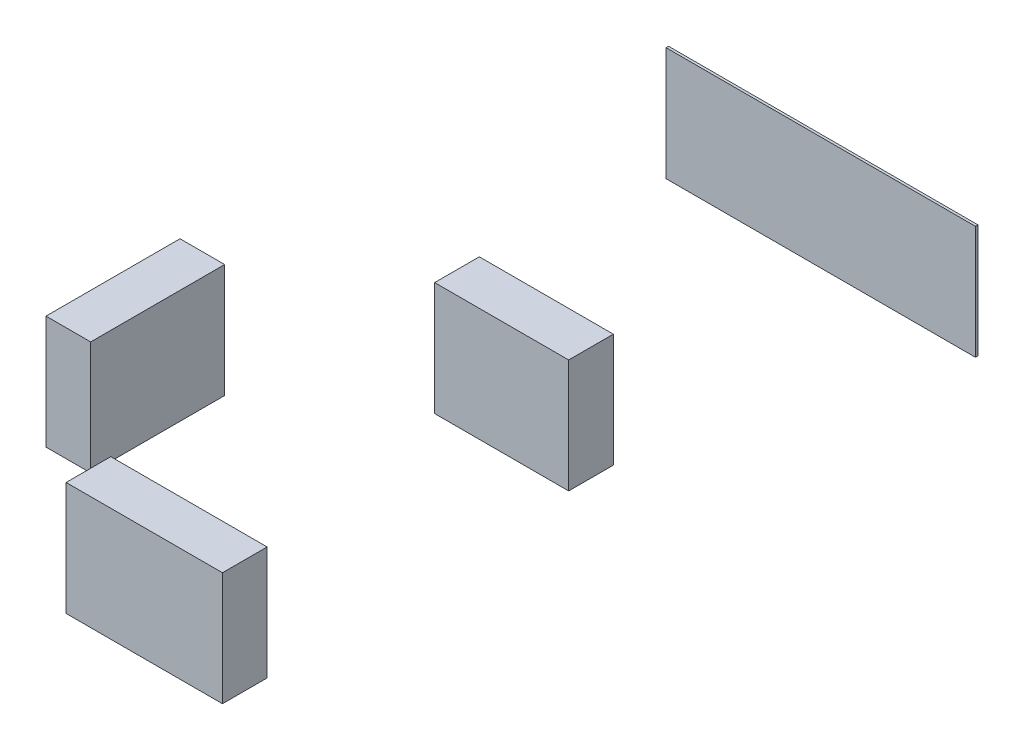
ISO-10303-21;
HEADER;
FILE_DESCRIPTION(('STEP AP214'),'2;1');
FILE_NAME('part.step','',(''),(''),'','','');
FILE_SCHEMA(('AUTOMOTIVE_DESIGN { 1 0 10303 214 1 1 1 1 }'));
ENDSEC;
DATA;
#1=APPLICATION_CONTEXT('core data for automotive mechanical design processes');
#2=APPLICATION_PROTOCOL_DEFINITION('international standard','automotive_design',2000,#1);
#3=PRODUCT_CONTEXT('',#1,'mechanical');
#4=PRODUCT('Part','Part','',(#3));
#5=PRODUCT_RELATED_PRODUCT_CATEGORY('part','',(#4));
#6=PRODUCT_DEFINITION_FORMATION('','',#4);
#7=PRODUCT_DEFINITION_CONTEXT('part definition',#1,'design');
#8=PRODUCT_DEFINITION('design','',#6,#7);
#9=PRODUCT_DEFINITION_SHAPE('','',#8);
#10=(LENGTH_UNIT() NAMED_UNIT(*) SI_UNIT(.MILLI.,.METRE.));
#11=(NAMED_UNIT(*) PLANE_ANGLE_UNIT() SI_UNIT($,.RADIAN.));
#12=(NAMED_UNIT(*) SI_UNIT($,.STERADIAN.) SOLID_ANGLE_UNIT());
#13=UNCERTAINTY_MEASURE_WITH_UNIT(LENGTH_MEASURE(1.E-05),#10,'distance_accuracy_value','');
#14=(GEOMETRIC_REPRESENTATION_CONTEXT(3) GLOBAL_UNCERTAINTY_ASSIGNED_CONTEXT((#13)) GLOBAL_UNIT_ASSIGNED_CONTEXT((#10,
#11,#12)) REPRESENTATION_CONTEXT('',''));
#15=CARTESIAN_POINT('',(0.,0.,0.));
#16=DIRECTION('',(0.,0.,1.));
#17=DIRECTION('',(1.,0.,0.));
#18=AXIS2_PLACEMENT_3D('',#15,#16,#17);
#19=CARTESIAN_POINT('',(3.2,2.54,-9.00000000000001));
#20=DIRECTION('',(1.,0.,0.));
#21=DIRECTION('',(0.,0.,-1.));
#22=AXIS2_PLACEMENT_3D('',#19,#20,#21);
#23=PLANE('',#22);
#24=DIRECTION('',(0.,0.,1.));
#25=VECTOR('',#24,1.);
#26=CARTESIAN_POINT('',(3.2,0.,-9.00000000000001));
#27=LINE('',#26,#25);
#28=CARTESIAN_POINT('',(3.2,0.,-9.00000000000001));
#29=VERTEX_POINT('',#28);
#30=CARTESIAN_POINT('',(3.2,0.,-8.00000000000001));
#31=VERTEX_POINT('',#30);
#32=EDGE_CURVE('E107',#29,#31,#27,.T.);
#33=ORIENTED_EDGE('',*,*,#32,.T.);
#34=DIRECTION('',(0.,-1.,0.));
#35=VECTOR('',#34,1.);
#36=CARTESIAN_POINT('',(3.2,2.54,-8.00000000000001));
#37=LINE('',#36,#35);
#38=CARTESIAN_POINT('',(3.2,2.54,-8.00000000000001));
#39=VERTEX_POINT('',#38);
#40=EDGE_CURVE('E12',#39,#31,#37,.T.);
#41=ORIENTED_EDGE('',*,*,#40,.F.);
#42=DIRECTION('',(0.,0.,1.));
#43=VECTOR('',#42,1.);
#44=CARTESIAN_POINT('',(3.2,2.54,-9.00000000000001));
#45=LINE('',#44,#43);
#46=CARTESIAN_POINT('',(3.2,2.54,-9.00000000000001));
#47=VERTEX_POINT('',#46);
#48=EDGE_CURVE('E95',#47,#39,#45,.T.);
#49=ORIENTED_EDGE('',*,*,#48,.F.);
#50=DIRECTION('',(0.,-1.,0.));
#51=VECTOR('',#50,1.);
#52=CARTESIAN_POINT('',(3.2,2.54,-9.00000000000001));
#53=LINE('',#52,#51);
#54=EDGE_CURVE('E103',#47,#29,#53,.T.);
#55=ORIENTED_EDGE('',*,*,#54,.T.);
#56=EDGE_LOOP('',(#33,#41,#49,#55));
#57=FACE_BOUND('',#56,.T.);
#58=ADVANCED_FACE('F44',(#57),#23,.F.);
#59=CARTESIAN_POINT('',(3.2,2.54,-8.00000000000001));
#60=DIRECTION('',(0.,0.,-1.));
#61=DIRECTION('',(-1.,0.,0.));
#62=AXIS2_PLACEMENT_3D('',#59,#60,#61);
#63=PLANE('',#62);
#64=DIRECTION('',(1.,0.,0.));
#65=VECTOR('',#64,1.);
#66=CARTESIAN_POINT('',(3.2,0.,-8.00000000000001));
#67=LINE('',#66,#65);
#68=CARTESIAN_POINT('',(6.2,0.,-8.00000000000001));
#69=VERTEX_POINT('',#68);
#70=EDGE_CURVE('E99',#31,#69,#67,.T.);
#71=ORIENTED_EDGE('',*,*,#70,.T.);
#72=DIRECTION('',(0.,-1.,0.));
#73=VECTOR('',#72,1.);
#74=CARTESIAN_POINT('',(6.2,2.54,-8.00000000000001));
#75=LINE('',#74,#73);
#76=CARTESIAN_POINT('',(6.2,2.54,-8.00000000000001));
#77=VERTEX_POINT('',#76);
#78=EDGE_CURVE('E52',#77,#69,#75,.T.);
#79=ORIENTED_EDGE('',*,*,#78,.F.);
#80=DIRECTION('',(1.,0.,0.));
#81=VECTOR('',#80,1.);
#82=CARTESIAN_POINT('',(3.2,2.54,-8.00000000000001));
#83=LINE('',#82,#81);
#84=EDGE_CURVE('E90',#39,#77,#83,.T.);
#85=ORIENTED_EDGE('',*,*,#84,.F.);
#86=ORIENTED_EDGE('',*,*,#40,.T.);
#87=EDGE_LOOP('',(#71,#79,#85,#86));
#88=FACE_BOUND('',#87,.T.);
#89=ADVANCED_FACE('F98',(#88),#63,.F.);
#90=CARTESIAN_POINT('',(6.2,2.54,-9.00000000000001));
#91=DIRECTION('',(-1.,0.,0.));
#92=DIRECTION('',(0.,0.,1.));
#93=AXIS2_PLACEMENT_3D('',#90,#91,#92);
#94=PLANE('',#93);
#95=DIRECTION('',(0.,0.,-1.));
#96=VECTOR('',#95,1.);
#97=CARTESIAN_POINT('',(6.2,0.,-9.00000000000001));
#98=LINE('',#97,#96);
#99=CARTESIAN_POINT('',(6.2,0.,-9.00000000000001));
#100=VERTEX_POINT('',#99);
#101=EDGE_CURVE('E77',#69,#100,#98,.T.);
#102=ORIENTED_EDGE('',*,*,#101,.T.);
#103=DIRECTION('',(0.,-1.,0.));
#104=VECTOR('',#103,1.);
#105=CARTESIAN_POINT('',(6.2,2.54,-9.00000000000001));
#106=LINE('',#105,#104);
#107=CARTESIAN_POINT('',(6.2,2.54,-9.00000000000001));
#108=VERTEX_POINT('',#107);
#109=EDGE_CURVE('E100',#108,#100,#106,.T.);
#110=ORIENTED_EDGE('',*,*,#109,.F.);
#111=DIRECTION('',(0.,0.,-1.));
#112=VECTOR('',#111,1.);
#113=CARTESIAN_POINT('',(6.2,2.54,-9.00000000000001));
#114=LINE('',#113,#112);
#115=EDGE_CURVE('E93',#77,#108,#114,.T.);
#116=ORIENTED_EDGE('',*,*,#115,.F.);
#117=ORIENTED_EDGE('',*,*,#78,.T.);
#118=EDGE_LOOP('',(#102,#110,#116,#117));
#119=FACE_BOUND('',#118,.T.);
#120=ADVANCED_FACE('F101',(#119),#94,.F.);
#121=CARTESIAN_POINT('',(3.2,2.54,-9.00000000000001));
#122=DIRECTION('',(0.,0.,1.));
#123=DIRECTION('',(1.,0.,0.));
#124=AXIS2_PLACEMENT_3D('',#121,#122,#123);
#125=PLANE('',#124);
#126=DIRECTION('',(-1.,0.,0.));
#127=VECTOR('',#126,1.);
#128=CARTESIAN_POINT('',(3.2,0.,-9.00000000000001));
#129=LINE('',#128,#127);
#130=EDGE_CURVE('E83',#100,#29,#129,.T.);
#131=ORIENTED_EDGE('',*,*,#130,.T.);
#132=ORIENTED_EDGE('',*,*,#54,.F.);
#133=DIRECTION('',(-1.,0.,0.));
#134=VECTOR('',#133,1.);
#135=CARTESIAN_POINT('',(3.2,2.54,-9.00000000000001));
#136=LINE('',#135,#134);
#137=EDGE_CURVE('E60',#108,#47,#136,.T.);
#138=ORIENTED_EDGE('',*,*,#137,.F.);
#139=ORIENTED_EDGE('',*,*,#109,.T.);
#140=EDGE_LOOP('',(#131,#132,#138,#139));
#141=FACE_BOUND('',#140,.T.);
#142=ADVANCED_FACE('F114',(#141),#125,.F.);
#143=CARTESIAN_POINT('',(3.2,2.54,-8.00000000000001));
#144=DIRECTION('',(0.,1.,0.));
#145=DIRECTION('',(0.,0.,1.));
#146=AXIS2_PLACEMENT_3D('',#143,#144,#145);
#147=PLANE('',#146);
#148=ORIENTED_EDGE('',*,*,#48,.T.);
#149=ORIENTED_EDGE('',*,*,#84,.T.);
#150=ORIENTED_EDGE('',*,*,#115,.T.);
#151=ORIENTED_EDGE('',*,*,#137,.T.);
#152=EDGE_LOOP('',(#148,#149,#150,#151));
#153=FACE_BOUND('',#152,.T.);
#154=ADVANCED_FACE('F91',(#153),#147,.T.);
#155=CARTESIAN_POINT('',(3.2,0.,-8.00000000000001));
#156=DIRECTION('',(0.,1.,0.));
#157=DIRECTION('',(0.,0.,1.));
#158=AXIS2_PLACEMENT_3D('',#155,#156,#157);
#159=PLANE('',#158);
#160=ORIENTED_EDGE('',*,*,#32,.F.);
#161=ORIENTED_EDGE('',*,*,#130,.F.);
#162=ORIENTED_EDGE('',*,*,#101,.F.);
#163=ORIENTED_EDGE('',*,*,#70,.F.);
#164=EDGE_LOOP('',(#160,#161,#162,#163));
#165=FACE_BOUND('',#164,.T.);
#166=ADVANCED_FACE('F117',(#165),#159,.F.);
#167=CLOSED_SHELL('',(#58,#89,#120,#142,#154,#166));
#168=MANIFOLD_SOLID_BREP('B2',#167);
#169=CARTESIAN_POINT('',(1.23679045429839,2.54,-15.1440851220631));
#170=DIRECTION('',(1.,0.,0.));
#171=DIRECTION('',(0.,0.,-1.));
#172=AXIS2_PLACEMENT_3D('',#169,#170,#171);
#173=PLANE('',#172);
#174=DIRECTION('',(0.,0.,1.));
#175=VECTOR('',#174,1.);
#176=CARTESIAN_POINT('',(1.23679045429839,0.,-15.1440851220631));
#177=LINE('',#176,#175);
#178=CARTESIAN_POINT('',(1.23679045429839,0.,-15.2));
#179=VERTEX_POINT('',#178);
#180=CARTESIAN_POINT('',(1.23679045429839,0.,-15.1440851220631));
#181=VERTEX_POINT('',#180);
#182=EDGE_CURVE('E241',#179,#181,#177,.T.);
#183=ORIENTED_EDGE('',*,*,#182,.T.);
#184=DIRECTION('',(0.,-1.,0.));
#185=VECTOR('',#184,1.);
#186=CARTESIAN_POINT('',(1.23679045429839,2.54,-15.1440851220631));
#187=LINE('',#186,#185);
#188=CARTESIAN_POINT('',(1.23679045429839,2.54,-15.1440851220631));
#189=VERTEX_POINT('',#188);
#190=EDGE_CURVE('E42',#189,#181,#187,.T.);
#191=ORIENTED_EDGE('',*,*,#190,.F.);
#192=DIRECTION('',(0.,0.,1.));
#193=VECTOR('',#192,1.);
#194=CARTESIAN_POINT('',(1.23679045429839,2.54,-15.1440851220631));
#195=LINE('',#194,#193);
#196=CARTESIAN_POINT('',(1.23679045429839,2.54,-15.2));
#197=VERTEX_POINT('',#196);
#198=EDGE_CURVE('E229',#197,#189,#195,.T.);
#199=ORIENTED_EDGE('',*,*,#198,.F.);
#200=DIRECTION('',(0.,-1.,0.));
#201=VECTOR('',#200,1.);
#202=CARTESIAN_POINT('',(1.23679045429839,2.54,-15.2));
#203=LINE('',#202,#201);
#204=EDGE_CURVE('E237',#197,#179,#203,.T.);
#205=ORIENTED_EDGE('',*,*,#204,.T.);
#206=EDGE_LOOP('',(#183,#191,#199,#205));
#207=FACE_BOUND('',#206,.T.);
#208=ADVANCED_FACE('F178',(#207),#173,.F.);
#209=CARTESIAN_POINT('',(8.16320954570161,2.54,-15.1440851220631));
#210=DIRECTION('',(0.,0.,-1.));
#211=DIRECTION('',(-1.,0.,0.));
#212=AXIS2_PLACEMENT_3D('',#209,#210,#211);
#213=PLANE('',#212);
#214=DIRECTION('',(1.,0.,0.));
#215=VECTOR('',#214,1.);
#216=CARTESIAN_POINT('',(8.16320954570161,0.,-15.1440851220631));
#217=LINE('',#216,#215);
#218=CARTESIAN_POINT('',(8.16320954570161,0.,-15.1440851220631));
#219=VERTEX_POINT('',#218);
#220=EDGE_CURVE('E233',#181,#219,#217,.T.);
#221=ORIENTED_EDGE('',*,*,#220,.T.);
#222=DIRECTION('',(0.,-1.,0.));
#223=VECTOR('',#222,1.);
#224=CARTESIAN_POINT('',(8.16320954570161,2.54,-15.1440851220631));
#225=LINE('',#224,#223);
#226=CARTESIAN_POINT('',(8.16320954570161,2.54,-15.1440851220631));
#227=VERTEX_POINT('',#226);
#228=EDGE_CURVE('E186',#227,#219,#225,.T.);
#229=ORIENTED_EDGE('',*,*,#228,.F.);
#230=DIRECTION('',(1.,0.,0.));
#231=VECTOR('',#230,1.);
#232=CARTESIAN_POINT('',(8.16320954570161,2.54,-15.1440851220631));
#233=LINE('',#232,#231);
#234=EDGE_CURVE('E224',#189,#227,#233,.T.);
#235=ORIENTED_EDGE('',*,*,#234,.F.);
#236=ORIENTED_EDGE('',*,*,#190,.T.);
#237=EDGE_LOOP('',(#221,#229,#235,#236));
#238=FACE_BOUND('',#237,.T.);
#239=ADVANCED_FACE('F232',(#238),#213,.F.);
#240=CARTESIAN_POINT('',(8.16320954570161,2.54,-15.2));
#241=DIRECTION('',(-1.,0.,0.));
#242=DIRECTION('',(0.,0.,1.));
#243=AXIS2_PLACEMENT_3D('',#240,#241,#242);
#244=PLANE('',#243);
#245=DIRECTION('',(0.,0.,-1.));
#246=VECTOR('',#245,1.);
#247=CARTESIAN_POINT('',(8.16320954570161,0.,-15.2));
#248=LINE('',#247,#246);
#249=CARTESIAN_POINT('',(8.16320954570161,0.,-15.2));
#250=VERTEX_POINT('',#249);
#251=EDGE_CURVE('E211',#219,#250,#248,.T.);
#252=ORIENTED_EDGE('',*,*,#251,.T.);
#253=DIRECTION('',(0.,-1.,0.));
#254=VECTOR('',#253,1.);
#255=CARTESIAN_POINT('',(8.16320954570161,2.54,-15.2));
#256=LINE('',#255,#254);
#257=CARTESIAN_POINT('',(8.16320954570161,2.54,-15.2));
#258=VERTEX_POINT('',#257);
#259=EDGE_CURVE('E234',#258,#250,#256,.T.);
#260=ORIENTED_EDGE('',*,*,#259,.F.);
#261=DIRECTION('',(0.,0.,-1.));
#262=VECTOR('',#261,1.);
#263=CARTESIAN_POINT('',(8.16320954570161,2.54,-15.2));
#264=LINE('',#263,#262);
#265=EDGE_CURVE('E227',#227,#258,#264,.T.);
#266=ORIENTED_EDGE('',*,*,#265,.F.);
#267=ORIENTED_EDGE('',*,*,#228,.T.);
#268=EDGE_LOOP('',(#252,#260,#266,#267));
#269=FACE_BOUND('',#268,.T.);
#270=ADVANCED_FACE('F235',(#269),#244,.F.);
#271=CARTESIAN_POINT('',(1.23679045429839,2.54,-15.2));
#272=DIRECTION('',(0.,0.,1.));
#273=DIRECTION('',(1.,0.,0.));
#274=AXIS2_PLACEMENT_3D('',#271,#272,#273);
#275=PLANE('',#274);
#276=DIRECTION('',(-1.,0.,0.));
#277=VECTOR('',#276,1.);
#278=CARTESIAN_POINT('',(1.23679045429839,0.,-15.2));
#279=LINE('',#278,#277);
#280=EDGE_CURVE('E217',#250,#179,#279,.T.);
#281=ORIENTED_EDGE('',*,*,#280,.T.);
#282=ORIENTED_EDGE('',*,*,#204,.F.);
#283=DIRECTION('',(-1.,0.,0.));
#284=VECTOR('',#283,1.);
#285=CARTESIAN_POINT('',(1.23679045429839,2.54,-15.2));
#286=LINE('',#285,#284);
#287=EDGE_CURVE('E194',#258,#197,#286,.T.);
#288=ORIENTED_EDGE('',*,*,#287,.F.);
#289=ORIENTED_EDGE('',*,*,#259,.T.);
#290=EDGE_LOOP('',(#281,#282,#288,#289));
#291=FACE_BOUND('',#290,.T.);
#292=ADVANCED_FACE('F248',(#291),#275,.F.);
#293=CARTESIAN_POINT('',(1.23679045429839,2.54,-15.2));
#294=DIRECTION('',(0.,-1.,0.));
#295=DIRECTION('',(0.,0.,-1.));
#296=AXIS2_PLACEMENT_3D('',#293,#294,#295);
#297=PLANE('',#296);
#298=ORIENTED_EDGE('',*,*,#198,.T.);
#299=ORIENTED_EDGE('',*,*,#234,.T.);
#300=ORIENTED_EDGE('',*,*,#265,.T.);
#301=ORIENTED_EDGE('',*,*,#287,.T.);
#302=EDGE_LOOP('',(#298,#299,#300,#301));
#303=FACE_BOUND('',#302,.T.);
#304=ADVANCED_FACE('F225',(#303),#297,.F.);
#305=CARTESIAN_POINT('',(1.23679045429839,0.,-15.2));
#306=DIRECTION('',(0.,-1.,0.));
#307=DIRECTION('',(0.,0.,-1.));
#308=AXIS2_PLACEMENT_3D('',#305,#306,#307);
#309=PLANE('',#308);
#310=ORIENTED_EDGE('',*,*,#182,.F.);
#311=ORIENTED_EDGE('',*,*,#280,.F.);
#312=ORIENTED_EDGE('',*,*,#251,.F.);
#313=ORIENTED_EDGE('',*,*,#220,.F.);
#314=EDGE_LOOP('',(#310,#311,#312,#313));
#315=FACE_BOUND('',#314,.T.);
#316=ADVANCED_FACE('F251',(#315),#309,.T.);
#317=CLOSED_SHELL('',(#208,#239,#270,#292,#304,#316));
#318=MANIFOLD_SOLID_BREP('B6',#317);
#319=CARTESIAN_POINT('',(-0.500000000000004,2.54,-6.00000000000001));
#320=DIRECTION('',(1.,0.,0.));
#321=DIRECTION('',(0.,0.,-1.));
#322=AXIS2_PLACEMENT_3D('',#319,#320,#321);
#323=PLANE('',#322);
#324=DIRECTION('',(0.,0.,1.));
#325=VECTOR('',#324,1.);
#326=CARTESIAN_POINT('',(-0.500000000000004,0.,-6.00000000000001));
#327=LINE('',#326,#325);
#328=CARTESIAN_POINT('',(-0.500000000000004,0.,-6.00000000000001));
#329=VERTEX_POINT('',#328);
#330=CARTESIAN_POINT('',(-0.5,0.,-3.));
#331=VERTEX_POINT('',#330);
#332=EDGE_CURVE('E374',#329,#331,#327,.T.);
#333=ORIENTED_EDGE('',*,*,#332,.T.);
#334=DIRECTION('',(0.,-1.,0.));
#335=VECTOR('',#334,1.);
#336=CARTESIAN_POINT('',(-0.5,2.54,-3.));
#337=LINE('',#336,#335);
#338=CARTESIAN_POINT('',(-0.5,2.54,-3.));
#339=VERTEX_POINT('',#338);
#340=EDGE_CURVE('E176',#339,#331,#337,.T.);
#341=ORIENTED_EDGE('',*,*,#340,.F.);
#342=DIRECTION('',(0.,0.,1.));
#343=VECTOR('',#342,1.);
#344=CARTESIAN_POINT('',(-0.500000000000004,2.54,-6.00000000000001));
#345=LINE('',#344,#343);
#346=CARTESIAN_POINT('',(-0.500000000000004,2.54,-6.00000000000001));
#347=VERTEX_POINT('',#346);
#348=EDGE_CURVE('E362',#347,#339,#345,.T.);
#349=ORIENTED_EDGE('',*,*,#348,.F.);
#350=DIRECTION('',(0.,-1.,0.));
#351=VECTOR('',#350,1.);
#352=CARTESIAN_POINT('',(-0.500000000000004,2.54,-6.00000000000001));
#353=LINE('',#352,#351);
#354=EDGE_CURVE('E370',#347,#329,#353,.T.);
#355=ORIENTED_EDGE('',*,*,#354,.T.);
#356=EDGE_LOOP('',(#333,#341,#349,#355));
#357=FACE_BOUND('',#356,.T.);
#358=ADVANCED_FACE('F311',(#357),#323,.F.);
#359=CARTESIAN_POINT('',(-0.5,2.54,-3.));
#360=DIRECTION('',(0.,0.,-1.));
#361=DIRECTION('',(-1.,0.,0.));
#362=AXIS2_PLACEMENT_3D('',#359,#360,#361);
#363=PLANE('',#362);
#364=DIRECTION('',(1.,0.,0.));
#365=VECTOR('',#364,1.);
#366=CARTESIAN_POINT('',(-0.5,0.,-3.));
#367=LINE('',#366,#365);
#368=CARTESIAN_POINT('',(0.5,0.,-3.));
#369=VERTEX_POINT('',#368);
#370=EDGE_CURVE('E366',#331,#369,#367,.T.);
#371=ORIENTED_EDGE('',*,*,#370,.T.);
#372=DIRECTION('',(0.,-1.,0.));
#373=VECTOR('',#372,1.);
#374=CARTESIAN_POINT('',(0.5,2.54,-3.));
#375=LINE('',#374,#373);
#376=CARTESIAN_POINT('',(0.5,2.54,-3.));
#377=VERTEX_POINT('',#376);
#378=EDGE_CURVE('E319',#377,#369,#375,.T.);
#379=ORIENTED_EDGE('',*,*,#378,.F.);
#380=DIRECTION('',(1.,0.,0.));
#381=VECTOR('',#380,1.);
#382=CARTESIAN_POINT('',(-0.5,2.54,-3.));
#383=LINE('',#382,#381);
#384=EDGE_CURVE('E357',#339,#377,#383,.T.);
#385=ORIENTED_EDGE('',*,*,#384,.F.);
#386=ORIENTED_EDGE('',*,*,#340,.T.);
#387=EDGE_LOOP('',(#371,#379,#385,#386));
#388=FACE_BOUND('',#387,.T.);
#389=ADVANCED_FACE('F365',(#388),#363,.F.);
#390=CARTESIAN_POINT('',(0.500000000000004,2.54,-6.00000000000001));
#391=DIRECTION('',(-1.,0.,0.));
#392=DIRECTION('',(0.,0.,1.));
#393=AXIS2_PLACEMENT_3D('',#390,#391,#392);
#394=PLANE('',#393);
#395=DIRECTION('',(0.,0.,-1.));
#396=VECTOR('',#395,1.);
#397=CARTESIAN_POINT('',(0.500000000000004,0.,-6.00000000000001));
#398=LINE('',#397,#396);
#399=CARTESIAN_POINT('',(0.500000000000004,0.,-6.00000000000001));
#400=VERTEX_POINT('',#399);
#401=EDGE_CURVE('E344',#369,#400,#398,.T.);
#402=ORIENTED_EDGE('',*,*,#401,.T.);
#403=DIRECTION('',(0.,-1.,0.));
#404=VECTOR('',#403,1.);
#405=CARTESIAN_POINT('',(0.500000000000004,2.54,-6.00000000000001));
#406=LINE('',#405,#404);
#407=CARTESIAN_POINT('',(0.500000000000004,2.54,-6.00000000000001));
#408=VERTEX_POINT('',#407);
#409=EDGE_CURVE('E367',#408,#400,#406,.T.);
#410=ORIENTED_EDGE('',*,*,#409,.F.);
#411=DIRECTION('',(0.,0.,-1.));
#412=VECTOR('',#411,1.);
#413=CARTESIAN_POINT('',(0.500000000000004,2.54,-6.00000000000001));
#414=LINE('',#413,#412);
#415=EDGE_CURVE('E360',#377,#408,#414,.T.);
#416=ORIENTED_EDGE('',*,*,#415,.F.);
#417=ORIENTED_EDGE('',*,*,#378,.T.);
#418=EDGE_LOOP('',(#402,#410,#416,#417));
#419=FACE_BOUND('',#418,.T.);
#420=ADVANCED_FACE('F368',(#419),#394,.F.);
#421=CARTESIAN_POINT('',(-0.500000000000004,2.54,-6.00000000000001));
#422=DIRECTION('',(0.,0.,1.));
#423=DIRECTION('',(1.,0.,0.));
#424=AXIS2_PLACEMENT_3D('',#421,#422,#423);
#425=PLANE('',#424);
#426=DIRECTION('',(-1.,0.,0.));
#427=VECTOR('',#426,1.);
#428=CARTESIAN_POINT('',(-0.500000000000004,0.,-6.00000000000001));
#429=LINE('',#428,#427);
#430=EDGE_CURVE('E350',#400,#329,#429,.T.);
#431=ORIENTED_EDGE('',*,*,#430,.T.);
#432=ORIENTED_EDGE('',*,*,#354,.F.);
#433=DIRECTION('',(-1.,0.,0.));
#434=VECTOR('',#433,1.);
#435=CARTESIAN_POINT('',(-0.500000000000004,2.54,-6.00000000000001));
#436=LINE('',#435,#434);
#437=EDGE_CURVE('E327',#408,#347,#436,.T.);
#438=ORIENTED_EDGE('',*,*,#437,.F.);
#439=ORIENTED_EDGE('',*,*,#409,.T.);
#440=EDGE_LOOP('',(#431,#432,#438,#439));
#441=FACE_BOUND('',#440,.T.);
#442=ADVANCED_FACE('F381',(#441),#425,.F.);
#443=CARTESIAN_POINT('',(-0.5,2.54,-3.));
#444=DIRECTION('',(0.,1.,0.));
#445=DIRECTION('',(0.,0.,1.));
#446=AXIS2_PLACEMENT_3D('',#443,#444,#445);
#447=PLANE('',#446);
#448=ORIENTED_EDGE('',*,*,#348,.T.);
#449=ORIENTED_EDGE('',*,*,#384,.T.);
#450=ORIENTED_EDGE('',*,*,#415,.T.);
#451=ORIENTED_EDGE('',*,*,#437,.T.);
#452=EDGE_LOOP('',(#448,#449,#450,#451));
#453=FACE_BOUND('',#452,.T.);
#454=ADVANCED_FACE('F358',(#453),#447,.T.);
#455=CARTESIAN_POINT('',(-0.5,0.,-3.));
#456=DIRECTION('',(0.,1.,0.));
#457=DIRECTION('',(0.,0.,1.));
#458=AXIS2_PLACEMENT_3D('',#455,#456,#457);
#459=PLANE('',#458);
#460=ORIENTED_EDGE('',*,*,#332,.F.);
#461=ORIENTED_EDGE('',*,*,#430,.F.);
#462=ORIENTED_EDGE('',*,*,#401,.F.);
#463=ORIENTED_EDGE('',*,*,#370,.F.);
#464=EDGE_LOOP('',(#460,#461,#462,#463));
#465=FACE_BOUND('',#464,.T.);
#466=ADVANCED_FACE('F384',(#465),#459,.F.);
#467=CLOSED_SHELL('',(#358,#389,#420,#442,#454,#466));
#468=MANIFOLD_SOLID_BREP('B36',#467);
#469=CARTESIAN_POINT('',(2.95,2.54,-1.));
#470=DIRECTION('',(1.,0.,0.));
#471=DIRECTION('',(0.,0.,-1.));
#472=AXIS2_PLACEMENT_3D('',#469,#470,#471);
#473=PLANE('',#472);
#474=DIRECTION('',(0.,0.,1.));
#475=VECTOR('',#474,1.);
#476=CARTESIAN_POINT('',(2.95,0.,-1.));
#477=LINE('',#476,#475);
#478=CARTESIAN_POINT('',(2.95,0.,-1.));
#479=VERTEX_POINT('',#478);
#480=CARTESIAN_POINT('',(2.95,0.,0.));
#481=VERTEX_POINT('',#480);
#482=EDGE_CURVE('E498',#479,#481,#477,.T.);
#483=ORIENTED_EDGE('',*,*,#482,.T.);
#484=DIRECTION('',(0.,-1.,0.));
#485=VECTOR('',#484,1.);
#486=CARTESIAN_POINT('',(2.95,2.54,0.));
#487=LINE('',#486,#485);
#488=CARTESIAN_POINT('',(2.95,2.54,0.));
#489=VERTEX_POINT('',#488);
#490=EDGE_CURVE('E309',#489,#481,#487,.T.);
#491=ORIENTED_EDGE('',*,*,#490,.F.);
#492=DIRECTION('',(0.,0.,1.));
#493=VECTOR('',#492,1.);
#494=CARTESIAN_POINT('',(2.95,2.54,-1.));
#495=LINE('',#494,#493);
#496=CARTESIAN_POINT('',(2.95,2.54,-1.));
#497=VERTEX_POINT('',#496);
#498=EDGE_CURVE('E486',#497,#489,#495,.T.);
#499=ORIENTED_EDGE('',*,*,#498,.F.);
#500=DIRECTION('',(0.,-1.,0.));
#501=VECTOR('',#500,1.);
#502=CARTESIAN_POINT('',(2.95,2.54,-1.));
#503=LINE('',#502,#501);
#504=EDGE_CURVE('E494',#497,#479,#503,.T.);
#505=ORIENTED_EDGE('',*,*,#504,.T.);
#506=EDGE_LOOP('',(#483,#491,#499,#505));
#507=FACE_BOUND('',#506,.T.);
#508=ADVANCED_FACE('F435',(#507),#473,.F.);
#509=CARTESIAN_POINT('',(2.95,2.54,0.));
#510=DIRECTION('',(0.,0.,-1.));
#511=DIRECTION('',(-1.,0.,0.));
#512=AXIS2_PLACEMENT_3D('',#509,#510,#511);
#513=PLANE('',#512);
#514=DIRECTION('',(1.,0.,0.));
#515=VECTOR('',#514,1.);
#516=CARTESIAN_POINT('',(2.95,0.,0.));
#517=LINE('',#516,#515);
#518=CARTESIAN_POINT('',(6.45,0.,0.));
#519=VERTEX_POINT('',#518);
#520=EDGE_CURVE('E490',#481,#519,#517,.T.);
#521=ORIENTED_EDGE('',*,*,#520,.T.);
#522=DIRECTION('',(0.,-1.,0.));
#523=VECTOR('',#522,1.);
#524=CARTESIAN_POINT('',(6.45,2.54,0.));
#525=LINE('',#524,#523);
#526=CARTESIAN_POINT('',(6.45,2.54,0.));
#527=VERTEX_POINT('',#526);
#528=EDGE_CURVE('E443',#527,#519,#525,.T.);
#529=ORIENTED_EDGE('',*,*,#528,.F.);
#530=DIRECTION('',(1.,0.,0.));
#531=VECTOR('',#530,1.);
#532=CARTESIAN_POINT('',(2.95,2.54,0.));
#533=LINE('',#532,#531);
#534=EDGE_CURVE('E481',#489,#527,#533,.T.);
#535=ORIENTED_EDGE('',*,*,#534,.F.);
#536=ORIENTED_EDGE('',*,*,#490,.T.);
#537=EDGE_LOOP('',(#521,#529,#535,#536));
#538=FACE_BOUND('',#537,.T.);
#539=ADVANCED_FACE('F489',(#538),#513,.F.);
#540=CARTESIAN_POINT('',(6.45,2.54,-1.));
#541=DIRECTION('',(-1.,0.,0.));
#542=DIRECTION('',(0.,0.,1.));
#543=AXIS2_PLACEMENT_3D('',#540,#541,#542);
#544=PLANE('',#543);
#545=DIRECTION('',(0.,0.,-1.));
#546=VECTOR('',#545,1.);
#547=CARTESIAN_POINT('',(6.45,0.,-1.));
#548=LINE('',#547,#546);
#549=CARTESIAN_POINT('',(6.45,0.,-1.));
#550=VERTEX_POINT('',#549);
#551=EDGE_CURVE('E468',#519,#550,#548,.T.);
#552=ORIENTED_EDGE('',*,*,#551,.T.);
#553=DIRECTION('',(0.,-1.,0.));
#554=VECTOR('',#553,1.);
#555=CARTESIAN_POINT('',(6.45,2.54,-1.));
#556=LINE('',#555,#554);
#557=CARTESIAN_POINT('',(6.45,2.54,-1.));
#558=VERTEX_POINT('',#557);
#559=EDGE_CURVE('E491',#558,#550,#556,.T.);
#560=ORIENTED_EDGE('',*,*,#559,.F.);
#561=DIRECTION('',(0.,0.,-1.));
#562=VECTOR('',#561,1.);
#563=CARTESIAN_POINT('',(6.45,2.54,-1.));
#564=LINE('',#563,#562);
#565=EDGE_CURVE('E484',#527,#558,#564,.T.);
#566=ORIENTED_EDGE('',*,*,#565,.F.);
#567=ORIENTED_EDGE('',*,*,#528,.T.);
#568=EDGE_LOOP('',(#552,#560,#566,#567));
#569=FACE_BOUND('',#568,.T.);
#570=ADVANCED_FACE('F492',(#569),#544,.F.);
#571=CARTESIAN_POINT('',(2.95,2.54,-1.));
#572=DIRECTION('',(0.,0.,1.));
#573=DIRECTION('',(1.,0.,0.));
#574=AXIS2_PLACEMENT_3D('',#571,#572,#573);
#575=PLANE('',#574);
#576=DIRECTION('',(-1.,0.,0.));
#577=VECTOR('',#576,1.);
#578=CARTESIAN_POINT('',(2.95,0.,-1.));
#579=LINE('',#578,#577);
#580=EDGE_CURVE('E474',#550,#479,#579,.T.);
#581=ORIENTED_EDGE('',*,*,#580,.T.);
#582=ORIENTED_EDGE('',*,*,#504,.F.);
#583=DIRECTION('',(-1.,0.,0.));
#584=VECTOR('',#583,1.);
#585=CARTESIAN_POINT('',(2.95,2.54,-1.));
#586=LINE('',#585,#584);
#587=EDGE_CURVE('E451',#558,#497,#586,.T.);
#588=ORIENTED_EDGE('',*,*,#587,.F.);
#589=ORIENTED_EDGE('',*,*,#559,.T.);
#590=EDGE_LOOP('',(#581,#582,#588,#589));
#591=FACE_BOUND('',#590,.T.);
#592=ADVANCED_FACE('F505',(#591),#575,.F.);
#593=CARTESIAN_POINT('',(2.95,2.54,0.));
#594=DIRECTION('',(0.,1.,0.));
#595=DIRECTION('',(0.,0.,1.));
#596=AXIS2_PLACEMENT_3D('',#593,#594,#595);
#597=PLANE('',#596);
#598=ORIENTED_EDGE('',*,*,#498,.T.);
#599=ORIENTED_EDGE('',*,*,#534,.T.);
#600=ORIENTED_EDGE('',*,*,#565,.T.);
#601=ORIENTED_EDGE('',*,*,#587,.T.);
#602=EDGE_LOOP('',(#598,#599,#600,#601));
#603=FACE_BOUND('',#602,.T.);
#604=ADVANCED_FACE('F482',(#603),#597,.T.);
#605=CARTESIAN_POINT('',(2.95,0.,0.));
#606=DIRECTION('',(0.,1.,0.));
#607=DIRECTION('',(0.,0.,1.));
#608=AXIS2_PLACEMENT_3D('',#605,#606,#607);
#609=PLANE('',#608);
#610=ORIENTED_EDGE('',*,*,#482,.F.);
#611=ORIENTED_EDGE('',*,*,#580,.F.);
#612=ORIENTED_EDGE('',*,*,#551,.F.);
#613=ORIENTED_EDGE('',*,*,#520,.F.);
#614=EDGE_LOOP('',(#610,#611,#612,#613));
#615=FACE_BOUND('',#614,.T.);
#616=ADVANCED_FACE('F508',(#615),#609,.F.);
#617=CLOSED_SHELL('',(#508,#539,#570,#592,#604,#616));
#618=MANIFOLD_SOLID_BREP('B170',#617);
#619=ADVANCED_BREP_SHAPE_REPRESENTATION('',(#18,#168,#318,#468,#618),#14);
#620=SHAPE_DEFINITION_REPRESENTATION(#9,#619);
ENDSEC;
END-ISO-10303-21;
